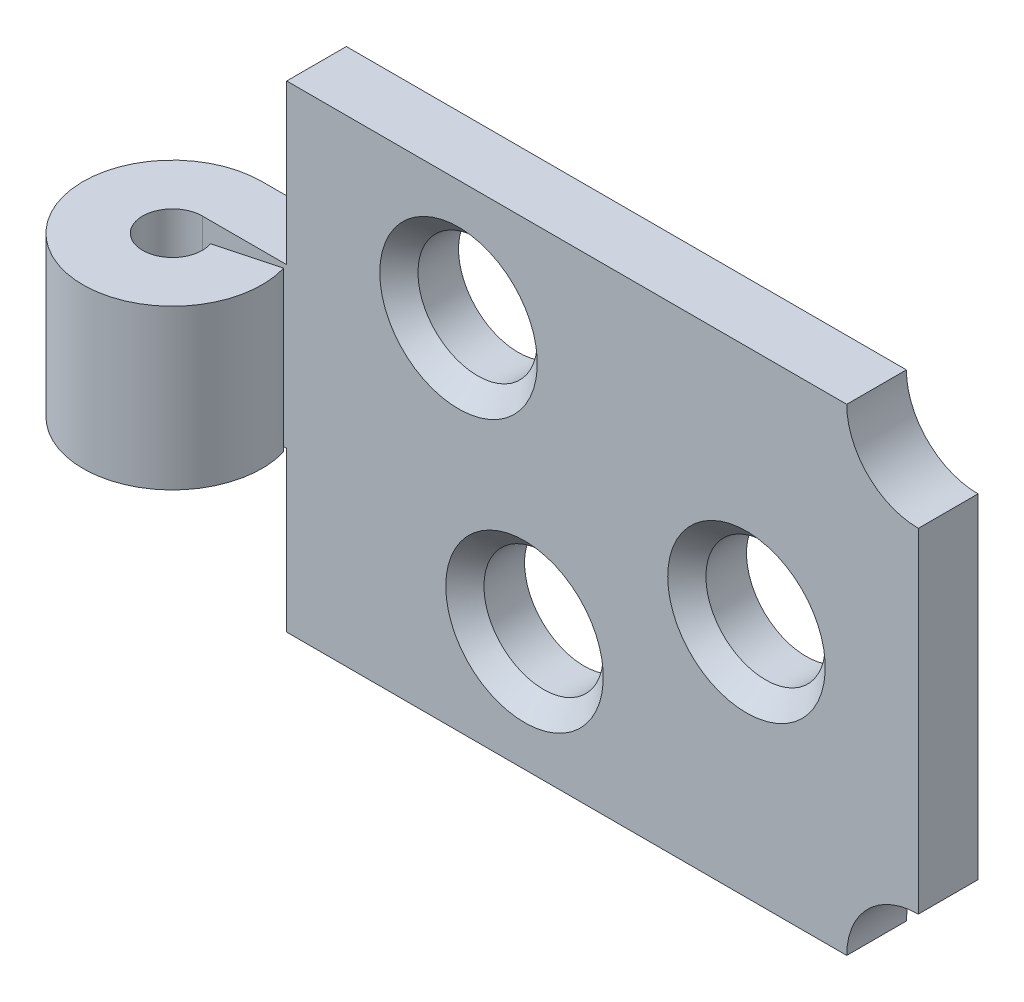
ISO-10303-21;
HEADER;
FILE_DESCRIPTION(('STEP AP214'),'2;1');
FILE_NAME('part.step','',(''),(''),'','','');
FILE_SCHEMA(('AUTOMOTIVE_DESIGN { 1 0 10303 214 1 1 1 1 }'));
ENDSEC;
DATA;
#1=APPLICATION_CONTEXT('core data for automotive mechanical design processes');
#2=APPLICATION_PROTOCOL_DEFINITION('international standard','automotive_design',2000,#1);
#3=PRODUCT_CONTEXT('',#1,'mechanical');
#4=PRODUCT('Part','Part','',(#3));
#5=PRODUCT_RELATED_PRODUCT_CATEGORY('part','',(#4));
#6=PRODUCT_DEFINITION_FORMATION('','',#4);
#7=PRODUCT_DEFINITION_CONTEXT('part definition',#1,'design');
#8=PRODUCT_DEFINITION('design','',#6,#7);
#9=PRODUCT_DEFINITION_SHAPE('','',#8);
#10=(LENGTH_UNIT() NAMED_UNIT(*) SI_UNIT(.MILLI.,.METRE.));
#11=(NAMED_UNIT(*) PLANE_ANGLE_UNIT() SI_UNIT($,.RADIAN.));
#12=(NAMED_UNIT(*) SI_UNIT($,.STERADIAN.) SOLID_ANGLE_UNIT());
#13=UNCERTAINTY_MEASURE_WITH_UNIT(LENGTH_MEASURE(1.E-05),#10,'distance_accuracy_value','');
#14=(GEOMETRIC_REPRESENTATION_CONTEXT(3) GLOBAL_UNCERTAINTY_ASSIGNED_CONTEXT((#13)) GLOBAL_UNIT_ASSIGNED_CONTEXT((#10,
#11,#12)) REPRESENTATION_CONTEXT('',''));
#15=CARTESIAN_POINT('',(0.,0.,0.));
#16=DIRECTION('',(0.,0.,1.));
#17=DIRECTION('',(1.,0.,0.));
#18=AXIS2_PLACEMENT_3D('',#15,#16,#17);
#19=CARTESIAN_POINT('',(-58.6013140302673,4.23333333333333,3.17500000000109));
#20=DIRECTION('',(0.,1.,0.));
#21=DIRECTION('',(0.,0.,1.));
#22=AXIS2_PLACEMENT_3D('',#19,#20,#21);
#23=PLANE('',#22);
#24=DIRECTION('',(1.,0.,0.));
#25=VECTOR('',#24,1.);
#26=CARTESIAN_POINT('',(-54.129220898895,4.23333333333333,1.58750000000109));
#27=LINE('',#26,#25);
#28=CARTESIAN_POINT('',(-58.6013140302673,4.23333333333333,1.58750000000107));
#29=VERTEX_POINT('',#28);
#30=CARTESIAN_POINT('',(-54.1111859697327,4.23333333333333,1.58750000000109));
#31=VERTEX_POINT('',#30);
#32=EDGE_CURVE('E252',#29,#31,#27,.T.);
#33=ORIENTED_EDGE('',*,*,#32,.T.);
#34=DIRECTION('',(0.,0.,-1.));
#35=VECTOR('',#34,1.);
#36=CARTESIAN_POINT('',(-54.1111859697327,4.23333333333333,3.17500000000109));
#37=LINE('',#36,#35);
#38=CARTESIAN_POINT('',(-54.1111859697327,4.23333333333333,-1.58749999999893));
#39=VERTEX_POINT('',#38);
#40=EDGE_CURVE('E229',#31,#39,#37,.T.);
#41=ORIENTED_EDGE('',*,*,#40,.T.);
#42=DIRECTION('',(-1.,0.,0.));
#43=VECTOR('',#42,1.);
#44=CARTESIAN_POINT('',(-58.6013140302673,4.23333333333333,-1.58749999999893));
#45=LINE('',#44,#43);
#46=CARTESIAN_POINT('',(-58.6013140302673,4.23333333333333,-1.58749999999893));
#47=VERTEX_POINT('',#46);
#48=EDGE_CURVE('E139',#39,#47,#45,.T.);
#49=ORIENTED_EDGE('',*,*,#48,.T.);
#50=CARTESIAN_POINT('',(-58.6013140302673,4.23333333333333,3.17500000000109));
#51=DIRECTION('',(0.,1.,0.));
#52=DIRECTION('',(0.,0.,1.));
#53=AXIS2_PLACEMENT_3D('',#50,#51,#52);
#54=CIRCLE('',#53,4.76250000000002);
#55=CARTESIAN_POINT('',(-54.0346769103412,4.23333333333333,1.82324866750176));
#56=VERTEX_POINT('',#55);
#57=EDGE_CURVE('E244',#47,#56,#54,.T.);
#58=ORIENTED_EDGE('',*,*,#57,.T.);
#59=DIRECTION('',(-0.965925826289068,0.,0.258819045102521));
#60=VECTOR('',#59,1.);
#61=CARTESIAN_POINT('',(-54.0346769103412,4.23333333333333,1.82324866750176));
#62=LINE('',#61,#60);
#63=CARTESIAN_POINT('',(-57.1046046767557,4.23333333333333,2.64583333333441));
#64=VERTEX_POINT('',#63);
#65=EDGE_CURVE('E246',#56,#64,#62,.T.);
#66=ORIENTED_EDGE('',*,*,#65,.T.);
#67=CARTESIAN_POINT('',(-58.6013140302673,4.23333333333333,3.17500000000109));
#68=DIRECTION('',(0.,-1.,0.));
#69=DIRECTION('',(0.,0.,1.));
#70=AXIS2_PLACEMENT_3D('',#67,#68,#69);
#71=CIRCLE('',#70,1.58750000000002);
#72=EDGE_CURVE('E248',#64,#29,#71,.T.);
#73=ORIENTED_EDGE('',*,*,#72,.T.);
#74=EDGE_LOOP('',(#33,#41,#49,#58,#66,#73));
#75=FACE_BOUND('',#74,.T.);
#76=ADVANCED_FACE('F27',(#75),#23,.T.);
#77=CARTESIAN_POINT('',(-58.6013140302673,-4.23333333333333,3.17500000000109));
#78=DIRECTION('',(0.,1.,0.));
#79=DIRECTION('',(0.,0.,1.));
#80=AXIS2_PLACEMENT_3D('',#77,#78,#79);
#81=PLANE('',#80);
#82=DIRECTION('',(0.,0.,-1.));
#83=VECTOR('',#82,1.);
#84=CARTESIAN_POINT('',(-54.1111859697327,-4.23333333333333,3.17500000000109));
#85=LINE('',#84,#83);
#86=CARTESIAN_POINT('',(-54.1111859697327,-4.23333333333333,1.58750000000107));
#87=VERTEX_POINT('',#86);
#88=CARTESIAN_POINT('',(-54.1111859697327,-4.23333333333333,-1.58749999999893));
#89=VERTEX_POINT('',#88);
#90=EDGE_CURVE('E151',#87,#89,#85,.T.);
#91=ORIENTED_EDGE('',*,*,#90,.F.);
#92=DIRECTION('',(1.,0.,0.));
#93=VECTOR('',#92,1.);
#94=CARTESIAN_POINT('',(-20.5013140302673,-4.23333333333333,1.58750000000107));
#95=LINE('',#94,#93);
#96=CARTESIAN_POINT('',(-58.6013140302673,-4.23333333333333,1.58750000000107));
#97=VERTEX_POINT('',#96);
#98=EDGE_CURVE('E241',#97,#87,#95,.T.);
#99=ORIENTED_EDGE('',*,*,#98,.F.);
#100=CARTESIAN_POINT('',(-58.6013140302673,-4.23333333333333,3.17500000000109));
#101=DIRECTION('',(0.,-1.,0.));
#102=DIRECTION('',(0.,0.,1.));
#103=AXIS2_PLACEMENT_3D('',#100,#101,#102);
#104=CIRCLE('',#103,1.58750000000002);
#105=CARTESIAN_POINT('',(-57.1046046767557,-4.23333333333333,2.64583333333441));
#106=VERTEX_POINT('',#105);
#107=EDGE_CURVE('E231',#106,#97,#104,.T.);
#108=ORIENTED_EDGE('',*,*,#107,.F.);
#109=DIRECTION('',(-0.965925826289068,0.,0.258819045102521));
#110=VECTOR('',#109,1.);
#111=CARTESIAN_POINT('',(-54.0346769103412,-4.23333333333333,1.82324866750176));
#112=LINE('',#111,#110);
#113=CARTESIAN_POINT('',(-54.0346769103412,-4.23333333333333,1.82324866750176));
#114=VERTEX_POINT('',#113);
#115=EDGE_CURVE('E228',#114,#106,#112,.T.);
#116=ORIENTED_EDGE('',*,*,#115,.F.);
#117=CARTESIAN_POINT('',(-58.6013140302673,-4.23333333333333,3.17500000000109));
#118=DIRECTION('',(0.,1.,0.));
#119=DIRECTION('',(0.,0.,1.));
#120=AXIS2_PLACEMENT_3D('',#117,#118,#119);
#121=CIRCLE('',#120,4.76250000000002);
#122=CARTESIAN_POINT('',(-58.6013140302673,-4.23333333333333,-1.58749999999893));
#123=VERTEX_POINT('',#122);
#124=EDGE_CURVE('E224',#123,#114,#121,.T.);
#125=ORIENTED_EDGE('',*,*,#124,.F.);
#126=DIRECTION('',(-1.,0.,0.));
#127=VECTOR('',#126,1.);
#128=CARTESIAN_POINT('',(-58.6013140302673,-4.23333333333333,-1.58749999999893));
#129=LINE('',#128,#127);
#130=EDGE_CURVE('E243',#89,#123,#129,.T.);
#131=ORIENTED_EDGE('',*,*,#130,.F.);
#132=EDGE_LOOP('',(#91,#99,#108,#116,#125,#131));
#133=FACE_BOUND('',#132,.T.);
#134=ADVANCED_FACE('F186',(#133),#81,.F.);
#135=CARTESIAN_POINT('',(-58.6013140302673,4.23333333333333,3.17500000000109));
#136=DIRECTION('',(0.,-1.,0.));
#137=DIRECTION('',(0.,0.,-1.));
#138=AXIS2_PLACEMENT_3D('',#135,#136,#137);
#139=CYLINDRICAL_SURFACE('',#138,4.76250000000002);
#140=ORIENTED_EDGE('',*,*,#124,.T.);
#141=DIRECTION('',(0.,-1.,0.));
#142=VECTOR('',#141,1.);
#143=CARTESIAN_POINT('',(-54.0346769103412,4.23333333333333,1.82324866750176));
#144=LINE('',#143,#142);
#145=EDGE_CURVE('E148',#56,#114,#144,.T.);
#146=ORIENTED_EDGE('',*,*,#145,.F.);
#147=ORIENTED_EDGE('',*,*,#57,.F.);
#148=DIRECTION('',(0.,-1.,0.));
#149=VECTOR('',#148,1.);
#150=CARTESIAN_POINT('',(-58.6013140302673,4.23333333333333,-1.58749999999893));
#151=LINE('',#150,#149);
#152=EDGE_CURVE('E134',#47,#123,#151,.T.);
#153=ORIENTED_EDGE('',*,*,#152,.T.);
#154=EDGE_LOOP('',(#140,#146,#147,#153));
#155=FACE_BOUND('',#154,.T.);
#156=ADVANCED_FACE('F192',(#155),#139,.T.);
#157=CARTESIAN_POINT('',(-54.0346769103412,4.23333333333333,1.82324866750176));
#158=DIRECTION('',(0.258819045102521,0.,0.965925826289068));
#159=DIRECTION('',(0.965925826289068,0.,-0.258819045102521));
#160=AXIS2_PLACEMENT_3D('',#157,#158,#159);
#161=PLANE('',#160);
#162=ORIENTED_EDGE('',*,*,#115,.T.);
#163=DIRECTION('',(0.,-1.,0.));
#164=VECTOR('',#163,1.);
#165=CARTESIAN_POINT('',(-57.1046046767557,4.23333333333333,2.64583333333441));
#166=LINE('',#165,#164);
#167=EDGE_CURVE('E145',#64,#106,#166,.T.);
#168=ORIENTED_EDGE('',*,*,#167,.F.);
#169=ORIENTED_EDGE('',*,*,#65,.F.);
#170=ORIENTED_EDGE('',*,*,#145,.T.);
#171=EDGE_LOOP('',(#162,#168,#169,#170));
#172=FACE_BOUND('',#171,.T.);
#173=ADVANCED_FACE('F212',(#172),#161,.F.);
#174=CARTESIAN_POINT('',(-58.6013140302673,4.23333333333333,3.17500000000109));
#175=DIRECTION('',(0.,-1.,0.));
#176=DIRECTION('',(0.,0.,-1.));
#177=AXIS2_PLACEMENT_3D('',#174,#175,#176);
#178=CYLINDRICAL_SURFACE('',#177,1.58750000000002);
#179=ORIENTED_EDGE('',*,*,#107,.T.);
#180=DIRECTION('',(0.,-1.,0.));
#181=VECTOR('',#180,1.);
#182=CARTESIAN_POINT('',(-58.6013140302673,4.23333333333333,1.58750000000107));
#183=LINE('',#182,#181);
#184=EDGE_CURVE('E136',#29,#97,#183,.T.);
#185=ORIENTED_EDGE('',*,*,#184,.F.);
#186=ORIENTED_EDGE('',*,*,#72,.F.);
#187=ORIENTED_EDGE('',*,*,#167,.T.);
#188=EDGE_LOOP('',(#179,#185,#186,#187));
#189=FACE_BOUND('',#188,.T.);
#190=ADVANCED_FACE('F208',(#189),#178,.F.);
#191=CARTESIAN_POINT('',(-20.5013140302673,4.23333333333333,1.58750000000107));
#192=DIRECTION('',(0.,0.,-1.));
#193=DIRECTION('',(-1.,0.,0.));
#194=AXIS2_PLACEMENT_3D('',#191,#192,#193);
#195=PLANE('',#194);
#196=CARTESIAN_POINT('',(-41.4563140302673,-6.35,1.58750000000108));
#197=DIRECTION('',(0.,0.,-1.));
#198=DIRECTION('',(-1.,0.,0.));
#199=AXIS2_PLACEMENT_3D('',#196,#197,#198);
#200=CIRCLE('',#199,4.19099999999999);
#201=CARTESIAN_POINT('',(-45.6473140302673,-6.35,1.58750000000108));
#202=VERTEX_POINT('',#201);
#203=EDGE_CURVE('E163',#202,#202,#200,.T.);
#204=ORIENTED_EDGE('',*,*,#203,.T.);
#205=EDGE_LOOP('',(#204));
#206=FACE_BOUND('',#205,.T.);
#207=CARTESIAN_POINT('',(-29.6453140302673,0.,1.58750000000108));
#208=DIRECTION('',(0.,0.,-1.));
#209=DIRECTION('',(-1.,0.,0.));
#210=AXIS2_PLACEMENT_3D('',#207,#208,#209);
#211=CIRCLE('',#210,4.19099999999999);
#212=CARTESIAN_POINT('',(-33.8363140302673,0.,1.58750000000108));
#213=VERTEX_POINT('',#212);
#214=EDGE_CURVE('E160',#213,#213,#211,.T.);
#215=ORIENTED_EDGE('',*,*,#214,.T.);
#216=EDGE_LOOP('',(#215));
#217=FACE_BOUND('',#216,.T.);
#218=CARTESIAN_POINT('',(-44.9671859697327,6.35,1.58750000000108));
#219=DIRECTION('',(0.,0.,-1.));
#220=DIRECTION('',(-1.,0.,0.));
#221=AXIS2_PLACEMENT_3D('',#218,#219,#220);
#222=CIRCLE('',#221,4.19099999999999);
#223=CARTESIAN_POINT('',(-49.1581859697327,6.35,1.58750000000109));
#224=VERTEX_POINT('',#223);
#225=EDGE_CURVE('E157',#224,#224,#222,.T.);
#226=ORIENTED_EDGE('',*,*,#225,.T.);
#227=EDGE_LOOP('',(#226));
#228=FACE_BOUND('',#227,.T.);
#229=DIRECTION('',(1.,0.,0.));
#230=VECTOR('',#229,1.);
#231=CARTESIAN_POINT('',(-54.1111859697327,-12.7,1.58750000000107));
#232=LINE('',#231,#230);
#233=CARTESIAN_POINT('',(-54.1111859697327,-12.7,1.58750000000107));
#234=VERTEX_POINT('',#233);
#235=CARTESIAN_POINT('',(-24.3113140302673,-12.7,1.58750000000107));
#236=VERTEX_POINT('',#235);
#237=EDGE_CURVE('E274',#234,#236,#232,.T.);
#238=ORIENTED_EDGE('',*,*,#237,.T.);
#239=CARTESIAN_POINT('',(-20.5013140302673,-12.7,1.58750000000109));
#240=DIRECTION('',(0.,0.,1.));
#241=DIRECTION('',(-1.,0.,0.));
#242=AXIS2_PLACEMENT_3D('',#239,#240,#241);
#243=CIRCLE('',#242,3.81);
#244=CARTESIAN_POINT('',(-20.5013140302673,-8.89,1.58750000000109));
#245=VERTEX_POINT('',#244);
#246=EDGE_CURVE('E42',#245,#236,#243,.T.);
#247=ORIENTED_EDGE('',*,*,#246,.F.);
#248=DIRECTION('',(0.,-1.,0.));
#249=VECTOR('',#248,1.);
#250=CARTESIAN_POINT('',(-20.5013140302673,4.23333333333333,1.58750000000107));
#251=LINE('',#250,#249);
#252=CARTESIAN_POINT('',(-20.5013140302673,8.89,1.58750000000109));
#253=VERTEX_POINT('',#252);
#254=EDGE_CURVE('E130',#253,#245,#251,.T.);
#255=ORIENTED_EDGE('',*,*,#254,.F.);
#256=CARTESIAN_POINT('',(-20.5013140302673,12.7,1.58750000000109));
#257=DIRECTION('',(0.,0.,1.));
#258=DIRECTION('',(1.,0.,0.));
#259=AXIS2_PLACEMENT_3D('',#256,#257,#258);
#260=CIRCLE('',#259,3.81);
#261=CARTESIAN_POINT('',(-24.3113140302673,12.7,1.58750000000109));
#262=VERTEX_POINT('',#261);
#263=EDGE_CURVE('E338',#262,#253,#260,.T.);
#264=ORIENTED_EDGE('',*,*,#263,.F.);
#265=DIRECTION('',(1.,0.,0.));
#266=VECTOR('',#265,1.);
#267=CARTESIAN_POINT('',(-54.1111859697327,12.7,1.58750000000107));
#268=LINE('',#267,#266);
#269=CARTESIAN_POINT('',(-54.1111859697327,12.7,1.58750000000107));
#270=VERTEX_POINT('',#269);
#271=EDGE_CURVE('E270',#270,#262,#268,.T.);
#272=ORIENTED_EDGE('',*,*,#271,.F.);
#273=DIRECTION('',(0.,-1.,0.));
#274=VECTOR('',#273,1.);
#275=CARTESIAN_POINT('',(-54.1111859697327,12.7,1.58750000000107));
#276=LINE('',#275,#274);
#277=EDGE_CURVE('E234',#270,#31,#276,.T.);
#278=ORIENTED_EDGE('',*,*,#277,.T.);
#279=ORIENTED_EDGE('',*,*,#32,.F.);
#280=ORIENTED_EDGE('',*,*,#184,.T.);
#281=ORIENTED_EDGE('',*,*,#98,.T.);
#282=EDGE_CURVE('E261',#87,#234,#276,.T.);
#283=ORIENTED_EDGE('',*,*,#282,.T.);
#284=EDGE_LOOP('',(#238,#247,#255,#264,#272,#278,#279,#280,#281,#283));
#285=FACE_BOUND('',#284,.T.);
#286=ADVANCED_FACE('F205',(#206,#217,#228,#285),#195,.F.);
#287=CARTESIAN_POINT('',(-20.5013140302673,4.23333333333333,-1.58749999999893));
#288=DIRECTION('',(-1.,0.,0.));
#289=DIRECTION('',(0.,0.,1.));
#290=AXIS2_PLACEMENT_3D('',#287,#288,#289);
#291=PLANE('',#290);
#292=ORIENTED_EDGE('',*,*,#254,.T.);
#293=DIRECTION('',(0.,0.,1.));
#294=VECTOR('',#293,1.);
#295=CARTESIAN_POINT('',(-20.5013140302673,-8.89,-1.58749999999893));
#296=LINE('',#295,#294);
#297=CARTESIAN_POINT('',(-20.5013140302673,-8.89,-1.58749999999893));
#298=VERTEX_POINT('',#297);
#299=EDGE_CURVE('E117',#298,#245,#296,.T.);
#300=ORIENTED_EDGE('',*,*,#299,.F.);
#301=DIRECTION('',(0.,-1.,0.));
#302=VECTOR('',#301,1.);
#303=CARTESIAN_POINT('',(-20.5013140302673,4.23333333333333,-1.58749999999893));
#304=LINE('',#303,#302);
#305=CARTESIAN_POINT('',(-20.5013140302673,8.89,-1.58749999999893));
#306=VERTEX_POINT('',#305);
#307=EDGE_CURVE('E128',#306,#298,#304,.T.);
#308=ORIENTED_EDGE('',*,*,#307,.F.);
#309=DIRECTION('',(0.,0.,1.));
#310=VECTOR('',#309,1.);
#311=CARTESIAN_POINT('',(-20.5013140302673,8.89,-1.58749999999893));
#312=LINE('',#311,#310);
#313=EDGE_CURVE('E277',#306,#253,#312,.T.);
#314=ORIENTED_EDGE('',*,*,#313,.T.);
#315=EDGE_LOOP('',(#292,#300,#308,#314));
#316=FACE_BOUND('',#315,.T.);
#317=ADVANCED_FACE('F126',(#316),#291,.F.);
#318=CARTESIAN_POINT('',(-58.6013140302673,4.23333333333333,-1.58749999999893));
#319=DIRECTION('',(0.,0.,1.));
#320=DIRECTION('',(1.,0.,0.));
#321=AXIS2_PLACEMENT_3D('',#318,#319,#320);
#322=PLANE('',#321);
#323=CARTESIAN_POINT('',(-41.4563140302673,-6.35,-1.58749999999893));
#324=DIRECTION('',(0.,0.,1.));
#325=DIRECTION('',(1.,0.,0.));
#326=AXIS2_PLACEMENT_3D('',#323,#324,#325);
#327=CIRCLE('',#326,3.175);
#328=CARTESIAN_POINT('',(-38.2813140302673,-6.35,-1.58749999999893));
#329=VERTEX_POINT('',#328);
#330=EDGE_CURVE('E328',#329,#329,#327,.T.);
#331=ORIENTED_EDGE('',*,*,#330,.T.);
#332=EDGE_LOOP('',(#331));
#333=FACE_BOUND('',#332,.T.);
#334=CARTESIAN_POINT('',(-29.6453140302673,0.,-1.58749999999893));
#335=DIRECTION('',(0.,0.,1.));
#336=DIRECTION('',(1.,0.,0.));
#337=AXIS2_PLACEMENT_3D('',#334,#335,#336);
#338=CIRCLE('',#337,3.17500000000001);
#339=CARTESIAN_POINT('',(-26.4703140302673,0.,-1.58749999999893));
#340=VERTEX_POINT('',#339);
#341=EDGE_CURVE('E329',#340,#340,#338,.T.);
#342=ORIENTED_EDGE('',*,*,#341,.T.);
#343=EDGE_LOOP('',(#342));
#344=FACE_BOUND('',#343,.T.);
#345=CARTESIAN_POINT('',(-44.9671859697327,6.35,-1.58749999999893));
#346=DIRECTION('',(0.,0.,1.));
#347=DIRECTION('',(1.,0.,0.));
#348=AXIS2_PLACEMENT_3D('',#345,#346,#347);
#349=CIRCLE('',#348,3.175);
#350=CARTESIAN_POINT('',(-41.7921859697327,6.35,-1.58749999999893));
#351=VERTEX_POINT('',#350);
#352=EDGE_CURVE('E332',#351,#351,#349,.T.);
#353=ORIENTED_EDGE('',*,*,#352,.T.);
#354=EDGE_LOOP('',(#353));
#355=FACE_BOUND('',#354,.T.);
#356=ORIENTED_EDGE('',*,*,#307,.T.);
#357=CARTESIAN_POINT('',(-20.5013140302673,-12.7,-1.58749999999893));
#358=DIRECTION('',(0.,0.,1.));
#359=DIRECTION('',(-1.,0.,0.));
#360=AXIS2_PLACEMENT_3D('',#357,#358,#359);
#361=CIRCLE('',#360,3.81);
#362=CARTESIAN_POINT('',(-24.3113140302673,-12.7,-1.58749999999893));
#363=VERTEX_POINT('',#362);
#364=EDGE_CURVE('E114',#298,#363,#361,.T.);
#365=ORIENTED_EDGE('',*,*,#364,.T.);
#366=DIRECTION('',(-1.,0.,0.));
#367=VECTOR('',#366,1.);
#368=CARTESIAN_POINT('',(-54.1111859697327,-12.7,-1.58749999999893));
#369=LINE('',#368,#367);
#370=CARTESIAN_POINT('',(-54.1111859697327,-12.7,-1.58749999999893));
#371=VERTEX_POINT('',#370);
#372=EDGE_CURVE('E271',#363,#371,#369,.T.);
#373=ORIENTED_EDGE('',*,*,#372,.T.);
#374=DIRECTION('',(0.,-1.,0.));
#375=VECTOR('',#374,1.);
#376=CARTESIAN_POINT('',(-54.1111859697327,12.7,-1.58749999999893));
#377=LINE('',#376,#375);
#378=EDGE_CURVE('E262',#89,#371,#377,.T.);
#379=ORIENTED_EDGE('',*,*,#378,.F.);
#380=ORIENTED_EDGE('',*,*,#130,.T.);
#381=ORIENTED_EDGE('',*,*,#152,.F.);
#382=ORIENTED_EDGE('',*,*,#48,.F.);
#383=CARTESIAN_POINT('',(-54.1111859697327,12.7,-1.58749999999893));
#384=VERTEX_POINT('',#383);
#385=EDGE_CURVE('E257',#384,#39,#377,.T.);
#386=ORIENTED_EDGE('',*,*,#385,.F.);
#387=DIRECTION('',(-1.,0.,0.));
#388=VECTOR('',#387,1.);
#389=CARTESIAN_POINT('',(-54.1111859697327,12.7,-1.58749999999893));
#390=LINE('',#389,#388);
#391=CARTESIAN_POINT('',(-24.3113140302673,12.7,-1.58749999999893));
#392=VERTEX_POINT('',#391);
#393=EDGE_CURVE('E259',#392,#384,#390,.T.);
#394=ORIENTED_EDGE('',*,*,#393,.F.);
#395=CARTESIAN_POINT('',(-20.5013140302673,12.7,-1.58749999999893));
#396=DIRECTION('',(0.,0.,1.));
#397=DIRECTION('',(1.,0.,0.));
#398=AXIS2_PLACEMENT_3D('',#395,#396,#397);
#399=CIRCLE('',#398,3.81);
#400=EDGE_CURVE('E50',#392,#306,#399,.T.);
#401=ORIENTED_EDGE('',*,*,#400,.T.);
#402=EDGE_LOOP('',(#356,#365,#373,#379,#380,#381,#382,#386,#394,#401));
#403=FACE_BOUND('',#402,.T.);
#404=ADVANCED_FACE('F132',(#333,#344,#355,#403),#322,.F.);
#405=CARTESIAN_POINT('',(-58.6013140302673,-12.7,3.17500000000109));
#406=DIRECTION('',(0.,1.,0.));
#407=DIRECTION('',(0.,0.,1.));
#408=AXIS2_PLACEMENT_3D('',#405,#406,#407);
#409=PLANE('',#408);
#410=ORIENTED_EDGE('',*,*,#372,.F.);
#411=DIRECTION('',(0.,0.,1.));
#412=VECTOR('',#411,1.);
#413=CARTESIAN_POINT('',(-24.3113140302673,-12.7,-1.58749999999893));
#414=LINE('',#413,#412);
#415=EDGE_CURVE('E118',#363,#236,#414,.T.);
#416=ORIENTED_EDGE('',*,*,#415,.T.);
#417=ORIENTED_EDGE('',*,*,#237,.F.);
#418=DIRECTION('',(0.,0.,1.));
#419=VECTOR('',#418,1.);
#420=CARTESIAN_POINT('',(-54.1111859697327,-12.7,-1.58749999999893));
#421=LINE('',#420,#419);
#422=EDGE_CURVE('E281',#371,#234,#421,.T.);
#423=ORIENTED_EDGE('',*,*,#422,.F.);
#424=EDGE_LOOP('',(#410,#416,#417,#423));
#425=FACE_BOUND('',#424,.T.);
#426=ADVANCED_FACE('F201',(#425),#409,.F.);
#427=CARTESIAN_POINT('',(-54.1111859697327,12.7,-1.58749999999893));
#428=DIRECTION('',(1.,0.,0.));
#429=DIRECTION('',(0.,0.,-1.));
#430=AXIS2_PLACEMENT_3D('',#427,#428,#429);
#431=PLANE('',#430);
#432=ORIENTED_EDGE('',*,*,#282,.F.);
#433=ORIENTED_EDGE('',*,*,#90,.T.);
#434=ORIENTED_EDGE('',*,*,#378,.T.);
#435=ORIENTED_EDGE('',*,*,#422,.T.);
#436=EDGE_LOOP('',(#432,#433,#434,#435));
#437=FACE_BOUND('',#436,.T.);
#438=ADVANCED_FACE('F293',(#437),#431,.F.);
#439=ORIENTED_EDGE('',*,*,#40,.F.);
#440=ORIENTED_EDGE('',*,*,#277,.F.);
#441=DIRECTION('',(0.,0.,1.));
#442=VECTOR('',#441,1.);
#443=CARTESIAN_POINT('',(-54.1111859697327,12.7,-1.58749999999893));
#444=LINE('',#443,#442);
#445=EDGE_CURVE('E266',#384,#270,#444,.T.);
#446=ORIENTED_EDGE('',*,*,#445,.F.);
#447=ORIENTED_EDGE('',*,*,#385,.T.);
#448=EDGE_LOOP('',(#439,#440,#446,#447));
#449=FACE_BOUND('',#448,.T.);
#450=ADVANCED_FACE('F196',(#449),#431,.F.);
#451=CARTESIAN_POINT('',(-58.6013140302673,12.7,3.17500000000109));
#452=DIRECTION('',(0.,1.,0.));
#453=DIRECTION('',(0.,0.,1.));
#454=AXIS2_PLACEMENT_3D('',#451,#452,#453);
#455=PLANE('',#454);
#456=DIRECTION('',(0.,0.,1.));
#457=VECTOR('',#456,1.);
#458=CARTESIAN_POINT('',(-24.3113140302673,12.7,-1.58749999999893));
#459=LINE('',#458,#457);
#460=EDGE_CURVE('E284',#392,#262,#459,.T.);
#461=ORIENTED_EDGE('',*,*,#460,.F.);
#462=ORIENTED_EDGE('',*,*,#393,.T.);
#463=ORIENTED_EDGE('',*,*,#445,.T.);
#464=ORIENTED_EDGE('',*,*,#271,.T.);
#465=EDGE_LOOP('',(#461,#462,#463,#464));
#466=FACE_BOUND('',#465,.T.);
#467=ADVANCED_FACE('F303',(#466),#455,.T.);
#468=CARTESIAN_POINT('',(-20.5013140302673,12.7,-1.58749999999893));
#469=DIRECTION('',(0.,0.,1.));
#470=DIRECTION('',(1.,0.,0.));
#471=AXIS2_PLACEMENT_3D('',#468,#469,#470);
#472=CYLINDRICAL_SURFACE('',#471,3.81);
#473=ORIENTED_EDGE('',*,*,#263,.T.);
#474=ORIENTED_EDGE('',*,*,#313,.F.);
#475=ORIENTED_EDGE('',*,*,#400,.F.);
#476=ORIENTED_EDGE('',*,*,#460,.T.);
#477=EDGE_LOOP('',(#473,#474,#475,#476));
#478=FACE_BOUND('',#477,.T.);
#479=ADVANCED_FACE('F309',(#478),#472,.F.);
#480=CARTESIAN_POINT('',(-20.5013140302673,-12.7,-1.58749999999893));
#481=DIRECTION('',(0.,0.,1.));
#482=DIRECTION('',(1.,0.,0.));
#483=AXIS2_PLACEMENT_3D('',#480,#481,#482);
#484=CYLINDRICAL_SURFACE('',#483,3.81);
#485=ORIENTED_EDGE('',*,*,#246,.T.);
#486=ORIENTED_EDGE('',*,*,#415,.F.);
#487=ORIENTED_EDGE('',*,*,#364,.F.);
#488=ORIENTED_EDGE('',*,*,#299,.T.);
#489=EDGE_LOOP('',(#485,#486,#487,#488));
#490=FACE_BOUND('',#489,.T.);
#491=ADVANCED_FACE('F116',(#490),#484,.F.);
#492=CARTESIAN_POINT('',(-44.9671859697327,6.35,-1.58749999999893));
#493=DIRECTION('',(0.,0.,1.));
#494=DIRECTION('',(1.,0.,0.));
#495=AXIS2_PLACEMENT_3D('',#492,#493,#494);
#496=CYLINDRICAL_SURFACE('',#495,3.175);
#497=CARTESIAN_POINT('',(-44.9671859697327,6.35,0.571500000001092));
#498=DIRECTION('',(0.,0.,-1.));
#499=DIRECTION('',(-1.,0.,0.));
#500=AXIS2_PLACEMENT_3D('',#497,#498,#499);
#501=CIRCLE('',#500,3.175);
#502=CARTESIAN_POINT('',(-48.1421859697327,6.35,0.571500000001092));
#503=VERTEX_POINT('',#502);
#504=EDGE_CURVE('E13',#503,#503,#501,.F.);
#505=ORIENTED_EDGE('',*,*,#504,.T.);
#506=EDGE_LOOP('',(#505));
#507=FACE_BOUND('',#506,.T.);
#508=ORIENTED_EDGE('',*,*,#352,.F.);
#509=EDGE_LOOP('',(#508));
#510=FACE_BOUND('',#509,.T.);
#511=ADVANCED_FACE('F314',(#507,#510),#496,.F.);
#512=CARTESIAN_POINT('',(-29.6453140302673,0.,-1.58749999999893));
#513=DIRECTION('',(0.,0.,1.));
#514=DIRECTION('',(1.,0.,0.));
#515=AXIS2_PLACEMENT_3D('',#512,#513,#514);
#516=CYLINDRICAL_SURFACE('',#515,3.17500000000001);
#517=CARTESIAN_POINT('',(-29.6453140302673,0.,0.571500000001101));
#518=DIRECTION('',(0.,0.,-1.));
#519=DIRECTION('',(-1.,0.,0.));
#520=AXIS2_PLACEMENT_3D('',#517,#518,#519);
#521=CIRCLE('',#520,3.17500000000001);
#522=CARTESIAN_POINT('',(-32.8203140302673,0.,0.571500000001101));
#523=VERTEX_POINT('',#522);
#524=EDGE_CURVE('E35',#523,#523,#521,.F.);
#525=ORIENTED_EDGE('',*,*,#524,.T.);
#526=EDGE_LOOP('',(#525));
#527=FACE_BOUND('',#526,.T.);
#528=ORIENTED_EDGE('',*,*,#341,.F.);
#529=EDGE_LOOP('',(#528));
#530=FACE_BOUND('',#529,.T.);
#531=ADVANCED_FACE('F168',(#527,#530),#516,.F.);
#532=CARTESIAN_POINT('',(-41.4563140302673,-6.35,-1.58749999999893));
#533=DIRECTION('',(0.,0.,1.));
#534=DIRECTION('',(1.,0.,0.));
#535=AXIS2_PLACEMENT_3D('',#532,#533,#534);
#536=CYLINDRICAL_SURFACE('',#535,3.175);
#537=CARTESIAN_POINT('',(-41.4563140302673,-6.35,0.57150000000109));
#538=DIRECTION('',(0.,0.,-1.));
#539=DIRECTION('',(-1.,0.,0.));
#540=AXIS2_PLACEMENT_3D('',#537,#538,#539);
#541=CIRCLE('',#540,3.175);
#542=CARTESIAN_POINT('',(-44.6313140302673,-6.35,0.57150000000109));
#543=VERTEX_POINT('',#542);
#544=EDGE_CURVE('E154',#543,#543,#541,.F.);
#545=ORIENTED_EDGE('',*,*,#544,.T.);
#546=EDGE_LOOP('',(#545));
#547=FACE_BOUND('',#546,.T.);
#548=ORIENTED_EDGE('',*,*,#330,.F.);
#549=EDGE_LOOP('',(#548));
#550=FACE_BOUND('',#549,.T.);
#551=ADVANCED_FACE('F181',(#547,#550),#536,.F.);
#552=CARTESIAN_POINT('',(-41.4563140302673,-6.35,0.57150000000109));
#553=DIRECTION('',(0.,0.,1.));
#554=DIRECTION('',(1.,0.,0.));
#555=AXIS2_PLACEMENT_3D('',#552,#553,#554);
#556=CONICAL_SURFACE('',#555,3.175,0.785398163397448);
#557=ORIENTED_EDGE('',*,*,#203,.F.);
#558=EDGE_LOOP('',(#557));
#559=FACE_BOUND('',#558,.T.);
#560=ORIENTED_EDGE('',*,*,#544,.F.);
#561=EDGE_LOOP('',(#560));
#562=FACE_BOUND('',#561,.T.);
#563=ADVANCED_FACE('F173',(#559,#562),#556,.F.);
#564=CARTESIAN_POINT('',(-29.6453140302673,0.,0.571500000001102));
#565=DIRECTION('',(0.,0.,1.));
#566=DIRECTION('',(1.,0.,0.));
#567=AXIS2_PLACEMENT_3D('',#564,#565,#566);
#568=CONICAL_SURFACE('',#567,3.17500000000001,0.785398163397451);
#569=ORIENTED_EDGE('',*,*,#214,.F.);
#570=EDGE_LOOP('',(#569));
#571=FACE_BOUND('',#570,.T.);
#572=ORIENTED_EDGE('',*,*,#524,.F.);
#573=EDGE_LOOP('',(#572));
#574=FACE_BOUND('',#573,.T.);
#575=ADVANCED_FACE('F171',(#571,#574),#568,.F.);
#576=CARTESIAN_POINT('',(-44.9671859697327,6.35,0.571500000001092));
#577=DIRECTION('',(0.,0.,1.));
#578=DIRECTION('',(1.,0.,0.));
#579=AXIS2_PLACEMENT_3D('',#576,#577,#578);
#580=CONICAL_SURFACE('',#579,3.175,0.785398163397448);
#581=ORIENTED_EDGE('',*,*,#225,.F.);
#582=EDGE_LOOP('',(#581));
#583=FACE_BOUND('',#582,.T.);
#584=ORIENTED_EDGE('',*,*,#504,.F.);
#585=EDGE_LOOP('',(#584));
#586=FACE_BOUND('',#585,.T.);
#587=ADVANCED_FACE('F29',(#583,#586),#580,.F.);
#588=CLOSED_SHELL('',(#76,#134,#156,#173,#190,#286,#317,#404,#426,#438,#450,#467,#479,#491,#511,
#531,#551,#563,#575,#587));
#589=MANIFOLD_SOLID_BREP('B1',#588);
#590=ADVANCED_BREP_SHAPE_REPRESENTATION('',(#18,#589),#14);
#591=SHAPE_DEFINITION_REPRESENTATION(#9,#590);
ENDSEC;
END-ISO-10303-21;
